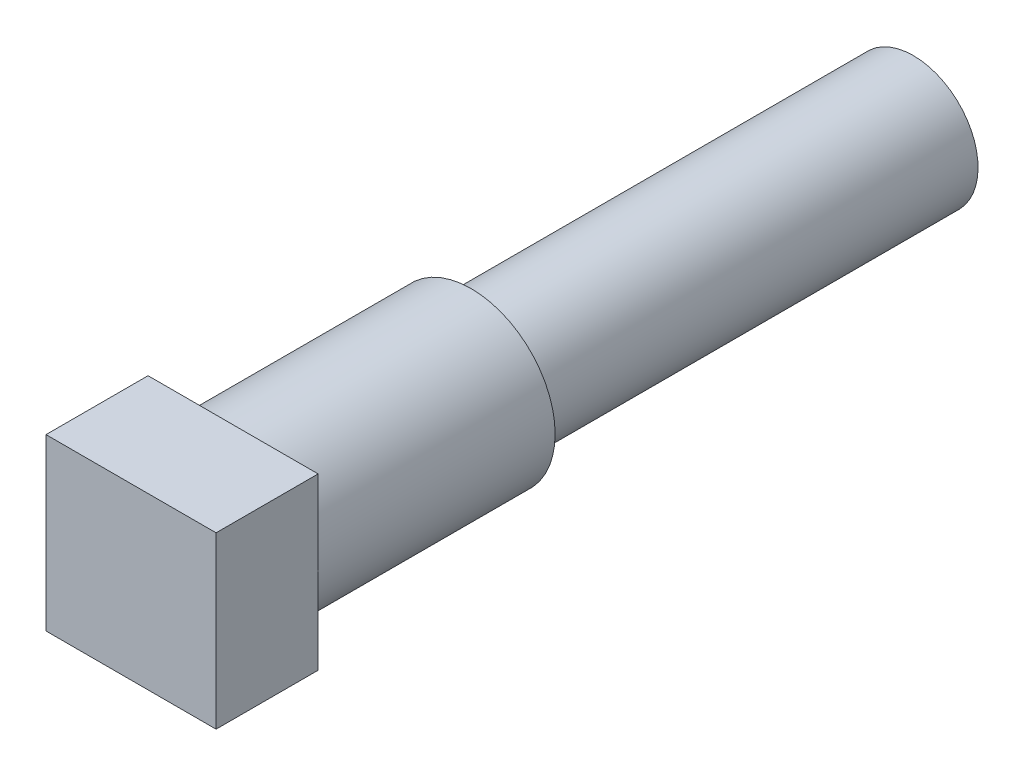
ISO-10303-21;
HEADER;
FILE_DESCRIPTION(('STEP AP214'),'2;1');
FILE_NAME('part.step','',(''),(''),'','','');
FILE_SCHEMA(('AUTOMOTIVE_DESIGN { 1 0 10303 214 1 1 1 1 }'));
ENDSEC;
DATA;
#1=APPLICATION_CONTEXT('core data for automotive mechanical design processes');
#2=APPLICATION_PROTOCOL_DEFINITION('international standard','automotive_design',2000,#1);
#3=PRODUCT_CONTEXT('',#1,'mechanical');
#4=PRODUCT('Part','Part','',(#3));
#5=PRODUCT_RELATED_PRODUCT_CATEGORY('part','',(#4));
#6=PRODUCT_DEFINITION_FORMATION('','',#4);
#7=PRODUCT_DEFINITION_CONTEXT('part definition',#1,'design');
#8=PRODUCT_DEFINITION('design','',#6,#7);
#9=PRODUCT_DEFINITION_SHAPE('','',#8);
#10=(LENGTH_UNIT() NAMED_UNIT(*) SI_UNIT(.MILLI.,.METRE.));
#11=(NAMED_UNIT(*) PLANE_ANGLE_UNIT() SI_UNIT($,.RADIAN.));
#12=(NAMED_UNIT(*) SI_UNIT($,.STERADIAN.) SOLID_ANGLE_UNIT());
#13=UNCERTAINTY_MEASURE_WITH_UNIT(LENGTH_MEASURE(1.E-05),#10,'distance_accuracy_value','');
#14=(GEOMETRIC_REPRESENTATION_CONTEXT(3) GLOBAL_UNCERTAINTY_ASSIGNED_CONTEXT((#13)) GLOBAL_UNIT_ASSIGNED_CONTEXT((#10,
#11,#12)) REPRESENTATION_CONTEXT('',''));
#15=CARTESIAN_POINT('',(0.,0.,0.));
#16=DIRECTION('',(0.,0.,1.));
#17=DIRECTION('',(1.,0.,0.));
#18=AXIS2_PLACEMENT_3D('',#15,#16,#17);
#19=CARTESIAN_POINT('',(0.,0.,-4.89208562730512));
#20=DIRECTION('',(0.,0.,1.));
#21=DIRECTION('',(0.,-1.,0.));
#22=AXIS2_PLACEMENT_3D('',#19,#20,#21);
#23=CYLINDRICAL_SURFACE('',#22,3.133725);
#24=CARTESIAN_POINT('',(0.,0.,-15.2400000000105));
#25=DIRECTION('',(0.,0.,-1.));
#26=DIRECTION('',(0.,1.,0.));
#27=AXIS2_PLACEMENT_3D('',#24,#25,#26);
#28=CIRCLE('',#27,3.133725);
#29=CARTESIAN_POINT('',(0.,3.133725,-15.2400000000105));
#30=VERTEX_POINT('',#29);
#31=EDGE_CURVE('E44',#30,#30,#28,.T.);
#32=ORIENTED_EDGE('',*,*,#31,.F.);
#33=EDGE_LOOP('',(#32));
#34=FACE_BOUND('',#33,.T.);
#35=CARTESIAN_POINT('',(0.,0.,-6.35));
#36=DIRECTION('',(0.,0.,1.));
#37=DIRECTION('',(1.,0.,0.));
#38=AXIS2_PLACEMENT_3D('',#35,#36,#37);
#39=CIRCLE('',#38,3.133725);
#40=CARTESIAN_POINT('',(3.133725,0.,-6.35));
#41=VERTEX_POINT('',#40);
#42=EDGE_CURVE('E38',#41,#41,#39,.T.);
#43=ORIENTED_EDGE('',*,*,#42,.F.);
#44=EDGE_LOOP('',(#43));
#45=FACE_BOUND('',#44,.T.);
#46=ADVANCED_FACE('F35',(#34,#45),#23,.T.);
#47=CARTESIAN_POINT('',(0.,0.,-15.2400000000105));
#48=DIRECTION('',(0.,0.,-1.));
#49=DIRECTION('',(0.,1.,0.));
#50=AXIS2_PLACEMENT_3D('',#47,#48,#49);
#51=PLANE('',#50);
#52=CARTESIAN_POINT('',(0.,0.,-15.2400000000105));
#53=DIRECTION('',(0.,0.,-1.));
#54=DIRECTION('',(0.,1.,0.));
#55=AXIS2_PLACEMENT_3D('',#52,#53,#54);
#56=CIRCLE('',#55,2.413);
#57=CARTESIAN_POINT('',(0.,2.413,-15.2400000000105));
#58=VERTEX_POINT('',#57);
#59=EDGE_CURVE('E11',#58,#58,#56,.T.);
#60=ORIENTED_EDGE('',*,*,#59,.F.);
#61=EDGE_LOOP('',(#60));
#62=FACE_BOUND('',#61,.T.);
#63=ORIENTED_EDGE('',*,*,#31,.T.);
#64=EDGE_LOOP('',(#63));
#65=FACE_BOUND('',#64,.T.);
#66=ADVANCED_FACE('F118',(#62,#65),#51,.T.);
#67=CARTESIAN_POINT('',(0.,0.,-31.7500000000105));
#68=DIRECTION('',(0.,0.,1.));
#69=DIRECTION('',(0.,-1.,0.));
#70=AXIS2_PLACEMENT_3D('',#67,#68,#69);
#71=CYLINDRICAL_SURFACE('',#70,2.413);
#72=CARTESIAN_POINT('',(0.,0.,-31.7500000000105));
#73=DIRECTION('',(0.,0.,-1.));
#74=DIRECTION('',(0.,1.,0.));
#75=AXIS2_PLACEMENT_3D('',#72,#73,#74);
#76=CIRCLE('',#75,2.413);
#77=CARTESIAN_POINT('',(0.,2.413,-31.7500000000105));
#78=VERTEX_POINT('',#77);
#79=EDGE_CURVE('E113',#78,#78,#76,.T.);
#80=ORIENTED_EDGE('',*,*,#79,.F.);
#81=EDGE_LOOP('',(#80));
#82=FACE_BOUND('',#81,.T.);
#83=ORIENTED_EDGE('',*,*,#59,.T.);
#84=EDGE_LOOP('',(#83));
#85=FACE_BOUND('',#84,.T.);
#86=ADVANCED_FACE('F149',(#82,#85),#71,.T.);
#87=CARTESIAN_POINT('',(0.,0.,-31.7500000000105));
#88=DIRECTION('',(0.,0.,-1.));
#89=DIRECTION('',(0.,1.,0.));
#90=AXIS2_PLACEMENT_3D('',#87,#88,#89);
#91=PLANE('',#90);
#92=ORIENTED_EDGE('',*,*,#79,.T.);
#93=EDGE_LOOP('',(#92));
#94=FACE_BOUND('',#93,.T.);
#95=ADVANCED_FACE('F146',(#94),#91,.T.);
#96=CARTESIAN_POINT('',(3.175,3.175,-2.54));
#97=DIRECTION('',(-1.,0.,0.));
#98=DIRECTION('',(0.,-1.,0.));
#99=AXIS2_PLACEMENT_3D('',#96,#97,#98);
#100=PLANE('',#99);
#101=DIRECTION('',(0.,1.,0.));
#102=VECTOR('',#101,1.);
#103=CARTESIAN_POINT('',(3.175,3.175,-6.35));
#104=LINE('',#103,#102);
#105=CARTESIAN_POINT('',(3.175,-3.175,-6.35));
#106=VERTEX_POINT('',#105);
#107=CARTESIAN_POINT('',(3.175,3.175,-6.35));
#108=VERTEX_POINT('',#107);
#109=EDGE_CURVE('E104',#106,#108,#104,.T.);
#110=ORIENTED_EDGE('',*,*,#109,.T.);
#111=DIRECTION('',(0.,0.,-1.));
#112=VECTOR('',#111,1.);
#113=CARTESIAN_POINT('',(3.175,3.175,-2.54));
#114=LINE('',#113,#112);
#115=CARTESIAN_POINT('',(3.175,3.175,-2.54));
#116=VERTEX_POINT('',#115);
#117=EDGE_CURVE('E95',#116,#108,#114,.T.);
#118=ORIENTED_EDGE('',*,*,#117,.F.);
#119=DIRECTION('',(0.,1.,0.));
#120=VECTOR('',#119,1.);
#121=CARTESIAN_POINT('',(3.175,3.175,-2.54));
#122=LINE('',#121,#120);
#123=CARTESIAN_POINT('',(3.175,-3.175,-2.54));
#124=VERTEX_POINT('',#123);
#125=EDGE_CURVE('E89',#124,#116,#122,.T.);
#126=ORIENTED_EDGE('',*,*,#125,.F.);
#127=DIRECTION('',(0.,0.,-1.));
#128=VECTOR('',#127,1.);
#129=CARTESIAN_POINT('',(3.175,-3.175,-2.54));
#130=LINE('',#129,#128);
#131=EDGE_CURVE('E100',#124,#106,#130,.T.);
#132=ORIENTED_EDGE('',*,*,#131,.T.);
#133=EDGE_LOOP('',(#110,#118,#126,#132));
#134=FACE_BOUND('',#133,.T.);
#135=ADVANCED_FACE('F131',(#134),#100,.F.);
#136=CARTESIAN_POINT('',(-3.175,3.175,-2.54));
#137=DIRECTION('',(0.,-1.,0.));
#138=DIRECTION('',(0.,0.,-1.));
#139=AXIS2_PLACEMENT_3D('',#136,#137,#138);
#140=PLANE('',#139);
#141=DIRECTION('',(-1.,0.,0.));
#142=VECTOR('',#141,1.);
#143=CARTESIAN_POINT('',(-3.175,3.175,-6.35));
#144=LINE('',#143,#142);
#145=CARTESIAN_POINT('',(-3.175,3.175,-6.35));
#146=VERTEX_POINT('',#145);
#147=EDGE_CURVE('E94',#108,#146,#144,.T.);
#148=ORIENTED_EDGE('',*,*,#147,.T.);
#149=DIRECTION('',(0.,0.,-1.));
#150=VECTOR('',#149,1.);
#151=CARTESIAN_POINT('',(-3.175,3.175,-2.54));
#152=LINE('',#151,#150);
#153=CARTESIAN_POINT('',(-3.175,3.175,-2.54));
#154=VERTEX_POINT('',#153);
#155=EDGE_CURVE('E92',#154,#146,#152,.T.);
#156=ORIENTED_EDGE('',*,*,#155,.F.);
#157=DIRECTION('',(-1.,0.,0.));
#158=VECTOR('',#157,1.);
#159=CARTESIAN_POINT('',(-3.175,3.175,-2.54));
#160=LINE('',#159,#158);
#161=EDGE_CURVE('E84',#116,#154,#160,.T.);
#162=ORIENTED_EDGE('',*,*,#161,.F.);
#163=ORIENTED_EDGE('',*,*,#117,.T.);
#164=EDGE_LOOP('',(#148,#156,#162,#163));
#165=FACE_BOUND('',#164,.T.);
#166=ADVANCED_FACE('F93',(#165),#140,.F.);
#167=CARTESIAN_POINT('',(-3.175,3.175,-2.54));
#168=DIRECTION('',(1.,0.,0.));
#169=DIRECTION('',(0.,1.,0.));
#170=AXIS2_PLACEMENT_3D('',#167,#168,#169);
#171=PLANE('',#170);
#172=DIRECTION('',(0.,-1.,0.));
#173=VECTOR('',#172,1.);
#174=CARTESIAN_POINT('',(-3.175,3.175,-6.35));
#175=LINE('',#174,#173);
#176=CARTESIAN_POINT('',(-3.175,-3.175,-6.35));
#177=VERTEX_POINT('',#176);
#178=EDGE_CURVE('E70',#146,#177,#175,.T.);
#179=ORIENTED_EDGE('',*,*,#178,.T.);
#180=DIRECTION('',(0.,0.,-1.));
#181=VECTOR('',#180,1.);
#182=CARTESIAN_POINT('',(-3.175,-3.175,-2.54));
#183=LINE('',#182,#181);
#184=CARTESIAN_POINT('',(-3.175,-3.175,-2.54));
#185=VERTEX_POINT('',#184);
#186=EDGE_CURVE('E96',#185,#177,#183,.T.);
#187=ORIENTED_EDGE('',*,*,#186,.F.);
#188=DIRECTION('',(0.,-1.,0.));
#189=VECTOR('',#188,1.);
#190=CARTESIAN_POINT('',(-3.175,3.175,-2.54));
#191=LINE('',#190,#189);
#192=EDGE_CURVE('E87',#154,#185,#191,.T.);
#193=ORIENTED_EDGE('',*,*,#192,.F.);
#194=ORIENTED_EDGE('',*,*,#155,.T.);
#195=EDGE_LOOP('',(#179,#187,#193,#194));
#196=FACE_BOUND('',#195,.T.);
#197=ADVANCED_FACE('F98',(#196),#171,.F.);
#198=CARTESIAN_POINT('',(-3.175,-3.175,-2.54));
#199=DIRECTION('',(0.,1.,0.));
#200=DIRECTION('',(0.,0.,1.));
#201=AXIS2_PLACEMENT_3D('',#198,#199,#200);
#202=PLANE('',#201);
#203=DIRECTION('',(1.,0.,0.));
#204=VECTOR('',#203,1.);
#205=CARTESIAN_POINT('',(-3.175,-3.175,-6.35));
#206=LINE('',#205,#204);
#207=EDGE_CURVE('E76',#177,#106,#206,.T.);
#208=ORIENTED_EDGE('',*,*,#207,.T.);
#209=ORIENTED_EDGE('',*,*,#131,.F.);
#210=DIRECTION('',(1.,0.,0.));
#211=VECTOR('',#210,1.);
#212=CARTESIAN_POINT('',(-3.175,-3.175,-2.54));
#213=LINE('',#212,#211);
#214=EDGE_CURVE('E53',#185,#124,#213,.T.);
#215=ORIENTED_EDGE('',*,*,#214,.F.);
#216=ORIENTED_EDGE('',*,*,#186,.T.);
#217=EDGE_LOOP('',(#208,#209,#215,#216));
#218=FACE_BOUND('',#217,.T.);
#219=ADVANCED_FACE('F132',(#218),#202,.F.);
#220=CARTESIAN_POINT('',(0.,0.,-2.54));
#221=DIRECTION('',(0.,0.,1.));
#222=DIRECTION('',(1.,0.,0.));
#223=AXIS2_PLACEMENT_3D('',#220,#221,#222);
#224=PLANE('',#223);
#225=ORIENTED_EDGE('',*,*,#125,.T.);
#226=ORIENTED_EDGE('',*,*,#161,.T.);
#227=ORIENTED_EDGE('',*,*,#192,.T.);
#228=ORIENTED_EDGE('',*,*,#214,.T.);
#229=EDGE_LOOP('',(#225,#226,#227,#228));
#230=FACE_BOUND('',#229,.T.);
#231=ADVANCED_FACE('F85',(#230),#224,.T.);
#232=CARTESIAN_POINT('',(0.,0.,-6.35));
#233=DIRECTION('',(0.,0.,1.));
#234=DIRECTION('',(1.,0.,0.));
#235=AXIS2_PLACEMENT_3D('',#232,#233,#234);
#236=PLANE('',#235);
#237=ORIENTED_EDGE('',*,*,#42,.T.);
#238=EDGE_LOOP('',(#237));
#239=FACE_BOUND('',#238,.T.);
#240=ORIENTED_EDGE('',*,*,#109,.F.);
#241=ORIENTED_EDGE('',*,*,#207,.F.);
#242=ORIENTED_EDGE('',*,*,#178,.F.);
#243=ORIENTED_EDGE('',*,*,#147,.F.);
#244=EDGE_LOOP('',(#240,#241,#242,#243));
#245=FACE_BOUND('',#244,.T.);
#246=ADVANCED_FACE('F125',(#239,#245),#236,.F.);
#247=CLOSED_SHELL('',(#46,#66,#86,#95,#135,#166,#197,#219,#231,#246));
#248=MANIFOLD_SOLID_BREP('B2',#247);
#249=ADVANCED_BREP_SHAPE_REPRESENTATION('',(#18,#248),#14);
#250=SHAPE_DEFINITION_REPRESENTATION(#9,#249);
ENDSEC;
END-ISO-10303-21;
